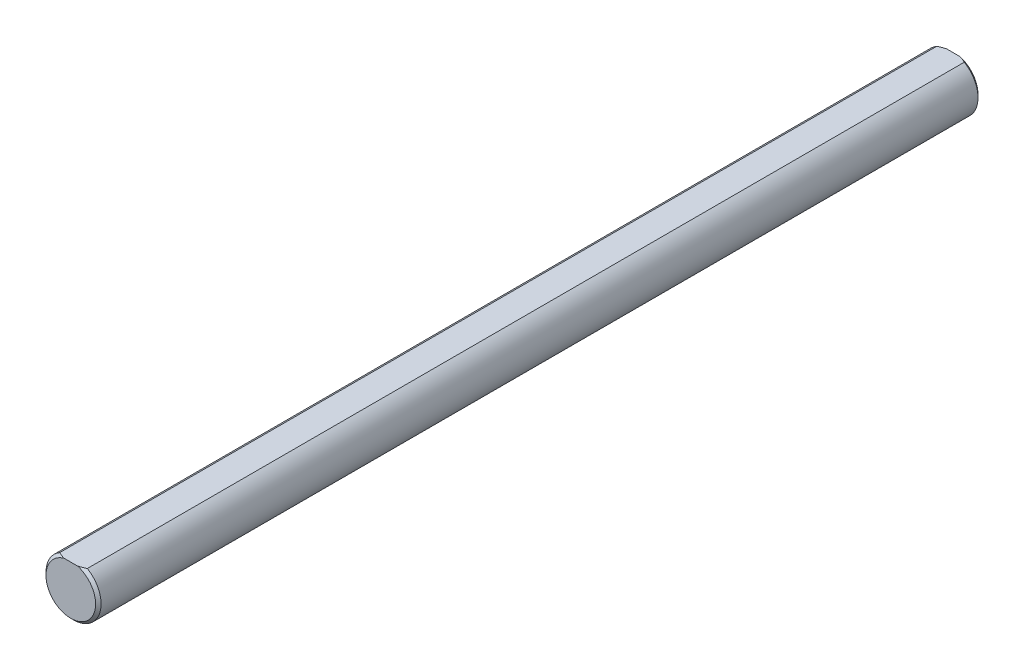
ISO-10303-21;
HEADER;
FILE_DESCRIPTION(('STEP AP214'),'2;1');
FILE_NAME('part.step','',(''),(''),'','','');
FILE_SCHEMA(('AUTOMOTIVE_DESIGN { 1 0 10303 214 1 1 1 1 }'));
ENDSEC;
DATA;
#1=APPLICATION_CONTEXT('core data for automotive mechanical design processes');
#2=APPLICATION_PROTOCOL_DEFINITION('international standard','automotive_design',2000,#1);
#3=PRODUCT_CONTEXT('',#1,'mechanical');
#4=PRODUCT('Part','Part','',(#3));
#5=PRODUCT_RELATED_PRODUCT_CATEGORY('part','',(#4));
#6=PRODUCT_DEFINITION_FORMATION('','',#4);
#7=PRODUCT_DEFINITION_CONTEXT('part definition',#1,'design');
#8=PRODUCT_DEFINITION('design','',#6,#7);
#9=PRODUCT_DEFINITION_SHAPE('','',#8);
#10=(LENGTH_UNIT() NAMED_UNIT(*) SI_UNIT(.MILLI.,.METRE.));
#11=(NAMED_UNIT(*) PLANE_ANGLE_UNIT() SI_UNIT($,.RADIAN.));
#12=(NAMED_UNIT(*) SI_UNIT($,.STERADIAN.) SOLID_ANGLE_UNIT());
#13=UNCERTAINTY_MEASURE_WITH_UNIT(LENGTH_MEASURE(1.E-05),#10,'distance_accuracy_value','');
#14=(GEOMETRIC_REPRESENTATION_CONTEXT(3) GLOBAL_UNCERTAINTY_ASSIGNED_CONTEXT((#13)) GLOBAL_UNIT_ASSIGNED_CONTEXT((#10,
#11,#12)) REPRESENTATION_CONTEXT('',''));
#15=CARTESIAN_POINT('',(0.,0.,0.));
#16=DIRECTION('',(0.,0.,1.));
#17=DIRECTION('',(1.,0.,0.));
#18=AXIS2_PLACEMENT_3D('',#15,#16,#17);
#19=CARTESIAN_POINT('',(0.,0.,76.2));
#20=DIRECTION('',(0.,0.,-1.));
#21=DIRECTION('',(-1.,0.,0.));
#22=AXIS2_PLACEMENT_3D('',#19,#20,#21);
#23=CYLINDRICAL_SURFACE('',#22,4.7625);
#24=DIRECTION('',(0.,0.,1.));
#25=VECTOR('',#24,1.);
#26=CARTESIAN_POINT('',(-2.38125,4.12444598552339,-76.2));
#27=LINE('',#26,#25);
#28=CARTESIAN_POINT('',(-2.38125,4.12444598552339,-75.7237499999999));
#29=VERTEX_POINT('',#28);
#30=CARTESIAN_POINT('',(-2.38125,4.12444598552339,75.72375));
#31=VERTEX_POINT('',#30);
#32=EDGE_CURVE('E79',#29,#31,#27,.T.);
#33=ORIENTED_EDGE('',*,*,#32,.F.);
#34=CARTESIAN_POINT('',(0.,0.,-75.7237499999999));
#35=DIRECTION('',(0.,0.,1.));
#36=DIRECTION('',(1.,0.,0.));
#37=AXIS2_PLACEMENT_3D('',#34,#35,#36);
#38=CIRCLE('',#37,4.7625);
#39=CARTESIAN_POINT('',(2.38125,4.12444598552339,-75.7237499999999));
#40=VERTEX_POINT('',#39);
#41=EDGE_CURVE('E90',#29,#40,#38,.T.);
#42=ORIENTED_EDGE('',*,*,#41,.T.);
#43=DIRECTION('',(0.,0.,1.));
#44=VECTOR('',#43,1.);
#45=CARTESIAN_POINT('',(2.38125,4.12444598552339,-76.2));
#46=LINE('',#45,#44);
#47=CARTESIAN_POINT('',(2.38125,4.12444598552339,75.72375));
#48=VERTEX_POINT('',#47);
#49=EDGE_CURVE('E92',#40,#48,#46,.T.);
#50=ORIENTED_EDGE('',*,*,#49,.T.);
#51=CARTESIAN_POINT('',(0.,0.,75.7237500000001));
#52=DIRECTION('',(0.,0.,1.));
#53=DIRECTION('',(1.,0.,0.));
#54=AXIS2_PLACEMENT_3D('',#51,#52,#53);
#55=CIRCLE('',#54,4.7625);
#56=EDGE_CURVE('E91',#48,#31,#55,.F.);
#57=ORIENTED_EDGE('',*,*,#56,.T.);
#58=EDGE_LOOP('',(#33,#42,#50,#57));
#59=FACE_BOUND('',#58,.T.);
#60=ADVANCED_FACE('F32',(#59),#23,.T.);
#61=CARTESIAN_POINT('',(0.,0.,76.2));
#62=DIRECTION('',(0.,0.,1.));
#63=DIRECTION('',(1.,0.,0.));
#64=AXIS2_PLACEMENT_3D('',#61,#62,#63);
#65=PLANE('',#64);
#66=DIRECTION('',(1.,0.,0.));
#67=VECTOR('',#66,1.);
#68=CARTESIAN_POINT('',(-2.38125,4.12444598552339,76.2));
#69=LINE('',#68,#67);
#70=CARTESIAN_POINT('',(-1.16656949000076,4.12444598552339,76.2));
#71=VERTEX_POINT('',#70);
#72=CARTESIAN_POINT('',(1.16656949000076,4.12444598552339,76.2));
#73=VERTEX_POINT('',#72);
#74=EDGE_CURVE('E133',#71,#73,#69,.T.);
#75=ORIENTED_EDGE('',*,*,#74,.F.);
#76=CARTESIAN_POINT('',(0.,0.,76.2));
#77=DIRECTION('',(0.,0.,1.));
#78=DIRECTION('',(1.,0.,0.));
#79=AXIS2_PLACEMENT_3D('',#76,#77,#78);
#80=CIRCLE('',#79,4.28625000000007);
#81=EDGE_CURVE('E11',#71,#73,#80,.T.);
#82=ORIENTED_EDGE('',*,*,#81,.T.);
#83=EDGE_LOOP('',(#75,#82));
#84=FACE_BOUND('',#83,.T.);
#85=ADVANCED_FACE('F126',(#84),#65,.T.);
#86=CARTESIAN_POINT('',(0.,0.,-76.2));
#87=DIRECTION('',(0.,0.,1.));
#88=DIRECTION('',(1.,0.,0.));
#89=AXIS2_PLACEMENT_3D('',#86,#87,#88);
#90=PLANE('',#89);
#91=DIRECTION('',(1.,0.,0.));
#92=VECTOR('',#91,1.);
#93=CARTESIAN_POINT('',(-2.38125,4.12444598552339,-76.2));
#94=LINE('',#93,#92);
#95=CARTESIAN_POINT('',(-1.16656948999999,4.12444598552339,-76.2));
#96=VERTEX_POINT('',#95);
#97=CARTESIAN_POINT('',(1.16656949,4.12444598552339,-76.2));
#98=VERTEX_POINT('',#97);
#99=EDGE_CURVE('E81',#96,#98,#94,.T.);
#100=ORIENTED_EDGE('',*,*,#99,.T.);
#101=CARTESIAN_POINT('',(0.,0.,-76.2));
#102=DIRECTION('',(0.,0.,1.));
#103=DIRECTION('',(1.,0.,0.));
#104=AXIS2_PLACEMENT_3D('',#101,#102,#103);
#105=CIRCLE('',#104,4.28624999999987);
#106=EDGE_CURVE('E41',#98,#96,#105,.F.);
#107=ORIENTED_EDGE('',*,*,#106,.T.);
#108=EDGE_LOOP('',(#100,#107));
#109=FACE_BOUND('',#108,.T.);
#110=ADVANCED_FACE('F109',(#109),#90,.F.);
#111=CARTESIAN_POINT('',(-2.38125,4.12444598552339,-76.2));
#112=DIRECTION('',(0.,-1.,0.));
#113=DIRECTION('',(0.,0.,-1.));
#114=AXIS2_PLACEMENT_3D('',#111,#112,#113);
#115=PLANE('',#114);
#116=ORIENTED_EDGE('',*,*,#49,.F.);
#117=CARTESIAN_POINT('',(2.38125,4.12444598552339,-75.7237499999999));
#118=CARTESIAN_POINT('',(2.28375775048901,4.12444598552339,-75.7724821237197));
#119=CARTESIAN_POINT('',(2.18535282357037,4.12444598552339,-75.819452861429));
#120=CARTESIAN_POINT('',(1.98687340615518,4.12444598552339,-75.9090387771377));
#121=CARTESIAN_POINT('',(1.8868035583158,4.12444598552339,-75.9516642705252));
#122=CARTESIAN_POINT('',(1.68463377003719,4.12444598552339,-76.0319880085566));
#123=CARTESIAN_POINT('',(1.58253298554234,4.12444598552339,-76.0696841531012));
#124=CARTESIAN_POINT('',(1.37613338518158,4.12444598552339,-76.1393732939213));
#125=CARTESIAN_POINT('',(1.27182981491284,4.12444598552339,-76.171352153296));
#126=CARTESIAN_POINT('',(1.16656948999999,4.12444598552339,-76.2));
#127=B_SPLINE_CURVE_WITH_KNOTS('',3,(#117,#118,#119,#120,#121,#122,#123,#124,#125,#126),
.UNSPECIFIED.,.F.,.F.,(4,2,2,2,4),(0.,0.327003853166796,0.653212394845981,0.979559464696196,
1.30670264352136),.UNSPECIFIED.);
#128=EDGE_CURVE('E85',#40,#98,#127,.T.);
#129=ORIENTED_EDGE('',*,*,#128,.T.);
#130=ORIENTED_EDGE('',*,*,#99,.F.);
#131=CARTESIAN_POINT('',(-1.16656948999999,4.12444598552339,-76.2));
#132=CARTESIAN_POINT('',(-1.27182981491284,4.12444598552339,-76.171352153296));
#133=CARTESIAN_POINT('',(-1.37613338518158,4.12444598552339,-76.1393732939213));
#134=CARTESIAN_POINT('',(-1.58253298554234,4.12444598552339,-76.0696841531012));
#135=CARTESIAN_POINT('',(-1.68463377003719,4.12444598552339,-76.0319880085566));
#136=CARTESIAN_POINT('',(-1.88680355831581,4.12444598552339,-75.9516642705252));
#137=CARTESIAN_POINT('',(-1.98687340615518,4.12444598552339,-75.9090387771377));
#138=CARTESIAN_POINT('',(-2.18535282357037,4.12444598552339,-75.819452861429));
#139=CARTESIAN_POINT('',(-2.28375775048901,4.12444598552339,-75.7724821237197));
#140=CARTESIAN_POINT('',(-2.38125,4.12444598552339,-75.7237499999999));
#141=B_SPLINE_CURVE_WITH_KNOTS('',3,(#131,#132,#133,#134,#135,#136,#137,#138,#139,#140),
.UNSPECIFIED.,.F.,.F.,(4,2,2,2,4),(0.,0.327143178825163,0.653490248675378,0.979698790354571,
1.30670264352136),.UNSPECIFIED.);
#142=EDGE_CURVE('E75',#96,#29,#141,.T.);
#143=ORIENTED_EDGE('',*,*,#142,.T.);
#144=ORIENTED_EDGE('',*,*,#32,.T.);
#145=CARTESIAN_POINT('',(-2.38125,4.12444598552339,75.7237500000001));
#146=CARTESIAN_POINT('',(-2.28375775048907,4.12444598552339,75.7724821237199));
#147=CARTESIAN_POINT('',(-2.18535282357048,4.12444598552339,75.8194528614291));
#148=CARTESIAN_POINT('',(-1.98687340615542,4.12444598552339,75.9090387771378));
#149=CARTESIAN_POINT('',(-1.88680355831611,4.12444598552339,75.9516642705253));
#150=CARTESIAN_POINT('',(-1.68463377003762,4.12444598552339,76.0319880085566));
#151=CARTESIAN_POINT('',(-1.58253298554284,4.12444598552339,76.0696841531012));
#152=CARTESIAN_POINT('',(-1.37613338518221,4.12444598552339,76.1393732939213));
#153=CARTESIAN_POINT('',(-1.27182981491353,4.12444598552339,76.1713521532961));
#154=CARTESIAN_POINT('',(-1.16656949000076,4.12444598552339,76.2));
#155=B_SPLINE_CURVE_WITH_KNOTS('',3,(#145,#146,#147,#148,#149,#150,#151,#152,#153,#154),
.UNSPECIFIED.,.F.,.F.,(4,2,2,2,4),(0.,0.327003853166599,0.653212394845584,0.9795594646956,
1.30670264352056),.UNSPECIFIED.);
#156=EDGE_CURVE('E55',#31,#71,#155,.T.);
#157=ORIENTED_EDGE('',*,*,#156,.T.);
#158=ORIENTED_EDGE('',*,*,#74,.T.);
#159=CARTESIAN_POINT('',(1.16656949000076,4.12444598552339,76.2));
#160=CARTESIAN_POINT('',(1.27182981491353,4.12444598552339,76.1713521532961));
#161=CARTESIAN_POINT('',(1.37613338518221,4.12444598552339,76.1393732939213));
#162=CARTESIAN_POINT('',(1.58253298554284,4.12444598552339,76.0696841531012));
#163=CARTESIAN_POINT('',(1.68463377003762,4.12444598552339,76.0319880085566));
#164=CARTESIAN_POINT('',(1.88680355831611,4.12444598552339,75.9516642705253));
#165=CARTESIAN_POINT('',(1.98687340615542,4.12444598552339,75.9090387771378));
#166=CARTESIAN_POINT('',(2.18535282357049,4.12444598552339,75.8194528614291));
#167=CARTESIAN_POINT('',(2.28375775048907,4.12444598552339,75.7724821237199));
#168=CARTESIAN_POINT('',(2.38125,4.12444598552339,75.7237500000001));
#169=B_SPLINE_CURVE_WITH_KNOTS('',3,(#159,#160,#161,#162,#163,#164,#165,#166,#167,#168),
.UNSPECIFIED.,.F.,.F.,(4,2,2,2,4),(0.,0.327143178824962,0.653490248674978,0.979698790353976,
1.30670264352056),.UNSPECIFIED.);
#170=EDGE_CURVE('E48',#73,#48,#169,.T.);
#171=ORIENTED_EDGE('',*,*,#170,.T.);
#172=EDGE_LOOP('',(#116,#129,#130,#143,#144,#157,#158,#171));
#173=FACE_BOUND('',#172,.T.);
#174=ADVANCED_FACE('F78',(#173),#115,.F.);
#175=CARTESIAN_POINT('',(0.,0.,-75.7237499999999));
#176=DIRECTION('',(0.,0.,1.));
#177=DIRECTION('',(1.,0.,0.));
#178=AXIS2_PLACEMENT_3D('',#175,#176,#177);
#179=CONICAL_SURFACE('',#178,4.7625,0.785398163397432);
#180=ORIENTED_EDGE('',*,*,#142,.F.);
#181=ORIENTED_EDGE('',*,*,#106,.F.);
#182=ORIENTED_EDGE('',*,*,#128,.F.);
#183=ORIENTED_EDGE('',*,*,#41,.F.);
#184=EDGE_LOOP('',(#180,#181,#182,#183));
#185=FACE_BOUND('',#184,.T.);
#186=ADVANCED_FACE('F94',(#185),#179,.T.);
#187=CARTESIAN_POINT('',(0.,0.,76.2));
#188=DIRECTION('',(0.,0.,-1.));
#189=DIRECTION('',(-1.,0.,0.));
#190=AXIS2_PLACEMENT_3D('',#187,#188,#189);
#191=CONICAL_SURFACE('',#190,4.28625000000007,0.785398163397447);
#192=ORIENTED_EDGE('',*,*,#156,.F.);
#193=ORIENTED_EDGE('',*,*,#56,.F.);
#194=ORIENTED_EDGE('',*,*,#170,.F.);
#195=ORIENTED_EDGE('',*,*,#81,.F.);
#196=EDGE_LOOP('',(#192,#193,#194,#195));
#197=FACE_BOUND('',#196,.T.);
#198=ADVANCED_FACE('F34',(#197),#191,.T.);
#199=CLOSED_SHELL('',(#60,#85,#110,#174,#186,#198));
#200=MANIFOLD_SOLID_BREP('B2',#199);
#201=ADVANCED_BREP_SHAPE_REPRESENTATION('',(#18,#200),#14);
#202=SHAPE_DEFINITION_REPRESENTATION(#9,#201);
ENDSEC;
END-ISO-10303-21;
